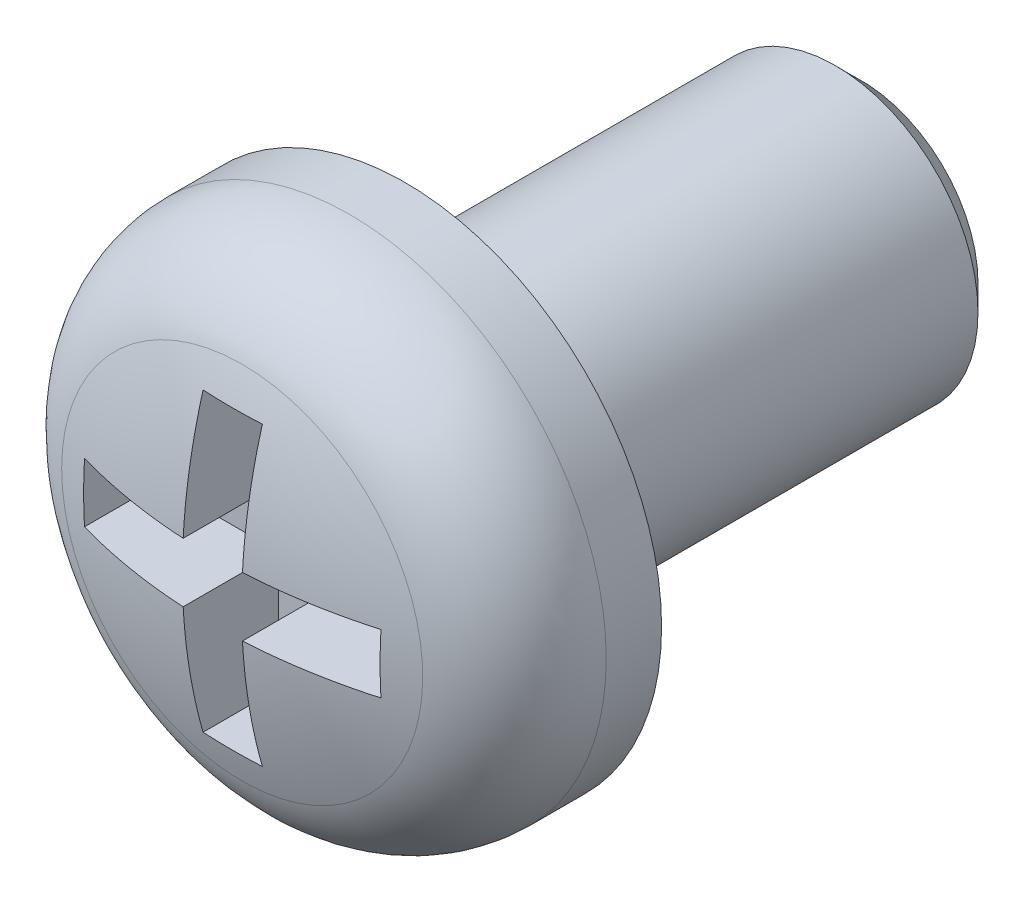
ISO-10303-21;
HEADER;
FILE_DESCRIPTION(('STEP AP214'),'2;1');
FILE_NAME('part.step','',(''),(''),'','','');
FILE_SCHEMA(('AUTOMOTIVE_DESIGN { 1 0 10303 214 1 1 1 1 }'));
ENDSEC;
DATA;
#1=APPLICATION_CONTEXT('core data for automotive mechanical design processes');
#2=APPLICATION_PROTOCOL_DEFINITION('international standard','automotive_design',2000,#1);
#3=PRODUCT_CONTEXT('',#1,'mechanical');
#4=PRODUCT('Part','Part','',(#3));
#5=PRODUCT_RELATED_PRODUCT_CATEGORY('part','',(#4));
#6=PRODUCT_DEFINITION_FORMATION('','',#4);
#7=PRODUCT_DEFINITION_CONTEXT('part definition',#1,'design');
#8=PRODUCT_DEFINITION('design','',#6,#7);
#9=PRODUCT_DEFINITION_SHAPE('','',#8);
#10=(LENGTH_UNIT() NAMED_UNIT(*) SI_UNIT(.MILLI.,.METRE.));
#11=(NAMED_UNIT(*) PLANE_ANGLE_UNIT() SI_UNIT($,.RADIAN.));
#12=(NAMED_UNIT(*) SI_UNIT($,.STERADIAN.) SOLID_ANGLE_UNIT());
#13=UNCERTAINTY_MEASURE_WITH_UNIT(LENGTH_MEASURE(1.E-05),#10,'distance_accuracy_value','');
#14=(GEOMETRIC_REPRESENTATION_CONTEXT(3) GLOBAL_UNCERTAINTY_ASSIGNED_CONTEXT((#13)) GLOBAL_UNIT_ASSIGNED_CONTEXT((#10,
#11,#12)) REPRESENTATION_CONTEXT('',''));
#15=CARTESIAN_POINT('',(0.,0.,0.));
#16=DIRECTION('',(0.,0.,1.));
#17=DIRECTION('',(1.,0.,0.));
#18=AXIS2_PLACEMENT_3D('',#15,#16,#17);
#19=CARTESIAN_POINT('',(0.,0.,-3.05024509803923));
#20=DIRECTION('',(0.,0.,1.));
#21=DIRECTION('',(0.,1.,0.));
#22=AXIS2_PLACEMENT_3D('',#19,#20,#21);
#23=SPHERICAL_SURFACE('',#22,4.75024509803923);
#24=CARTESIAN_POINT('',(0.,0.,1.42836551604378));
#25=DIRECTION('',(0.,0.,-1.));
#26=DIRECTION('',(-1.,0.,0.));
#27=AXIS2_PLACEMENT_3D('',#24,#25,#26);
#28=CIRCLE('',#27,1.58331154826482);
#29=CARTESIAN_POINT('',(-1.58331154826482,0.,1.42836551604378));
#30=VERTEX_POINT('',#29);
#31=EDGE_CURVE('E201',#30,#30,#28,.F.);
#32=ORIENTED_EDGE('',*,*,#31,.T.);
#33=EDGE_LOOP('',(#32));
#34=FACE_BOUND('',#33,.T.);
#35=CARTESIAN_POINT('',(0.259999999999999,0.,-3.05024509803923));
#36=DIRECTION('',(-1.,0.,0.));
#37=DIRECTION('',(0.,-1.,0.));
#38=AXIS2_PLACEMENT_3D('',#35,#36,#37);
#39=CIRCLE('',#38,4.74312433860275);
#40=CARTESIAN_POINT('',(0.259999999999999,0.26,1.6857477747854));
#41=VERTEX_POINT('',#40);
#42=CARTESIAN_POINT('',(0.26,1.3,1.51124900931701));
#43=VERTEX_POINT('',#42);
#44=EDGE_CURVE('E148',#41,#43,#39,.T.);
#45=ORIENTED_EDGE('',*,*,#44,.F.);
#46=CARTESIAN_POINT('',(0.,0.26,-3.05024509803923));
#47=DIRECTION('',(0.,-1.,0.));
#48=DIRECTION('',(1.,0.,0.));
#49=AXIS2_PLACEMENT_3D('',#46,#47,#48);
#50=CIRCLE('',#49,4.74312433860275);
#51=CARTESIAN_POINT('',(1.3,0.26,1.51124900931701));
#52=VERTEX_POINT('',#51);
#53=EDGE_CURVE('E62',#52,#41,#50,.T.);
#54=ORIENTED_EDGE('',*,*,#53,.F.);
#55=CARTESIAN_POINT('',(1.3,0.,-3.05024509803923));
#56=DIRECTION('',(-1.,0.,0.));
#57=DIRECTION('',(0.,-1.,0.));
#58=AXIS2_PLACEMENT_3D('',#55,#56,#57);
#59=CIRCLE('',#58,4.56889795152461);
#60=CARTESIAN_POINT('',(1.3,-0.26,1.51124900931701));
#61=VERTEX_POINT('',#60);
#62=EDGE_CURVE('E194',#61,#52,#59,.T.);
#63=ORIENTED_EDGE('',*,*,#62,.F.);
#64=CARTESIAN_POINT('',(0.,-0.259999999999999,-3.05024509803923));
#65=DIRECTION('',(0.,1.,0.));
#66=DIRECTION('',(-1.,0.,0.));
#67=AXIS2_PLACEMENT_3D('',#64,#65,#66);
#68=CIRCLE('',#67,4.74312433860275);
#69=CARTESIAN_POINT('',(0.26,-0.259999999999999,1.6857477747854));
#70=VERTEX_POINT('',#69);
#71=EDGE_CURVE('E191',#70,#61,#68,.T.);
#72=ORIENTED_EDGE('',*,*,#71,.F.);
#73=CARTESIAN_POINT('',(0.26,0.,-3.05024509803923));
#74=DIRECTION('',(-1.,0.,0.));
#75=DIRECTION('',(0.,-1.,0.));
#76=AXIS2_PLACEMENT_3D('',#73,#74,#75);
#77=CIRCLE('',#76,4.74312433860275);
#78=CARTESIAN_POINT('',(0.259999999999999,-1.3,1.51124900931701));
#79=VERTEX_POINT('',#78);
#80=EDGE_CURVE('E188',#79,#70,#77,.T.);
#81=ORIENTED_EDGE('',*,*,#80,.F.);
#82=CARTESIAN_POINT('',(0.,-1.3,-3.05024509803923));
#83=DIRECTION('',(0.,1.,0.));
#84=DIRECTION('',(-1.,0.,0.));
#85=AXIS2_PLACEMENT_3D('',#82,#83,#84);
#86=CIRCLE('',#85,4.56889795152461);
#87=CARTESIAN_POINT('',(-0.26,-1.3,1.51124900931701));
#88=VERTEX_POINT('',#87);
#89=EDGE_CURVE('E185',#88,#79,#86,.T.);
#90=ORIENTED_EDGE('',*,*,#89,.F.);
#91=CARTESIAN_POINT('',(-0.26,0.,-3.05024509803923));
#92=DIRECTION('',(1.,0.,0.));
#93=DIRECTION('',(0.,1.,0.));
#94=AXIS2_PLACEMENT_3D('',#91,#92,#93);
#95=CIRCLE('',#94,4.74312433860275);
#96=CARTESIAN_POINT('',(-0.26,-0.26,1.6857477747854));
#97=VERTEX_POINT('',#96);
#98=EDGE_CURVE('E182',#97,#88,#95,.T.);
#99=ORIENTED_EDGE('',*,*,#98,.F.);
#100=CARTESIAN_POINT('',(0.,-0.26,-3.05024509803923));
#101=DIRECTION('',(0.,1.,0.));
#102=DIRECTION('',(-1.,0.,0.));
#103=AXIS2_PLACEMENT_3D('',#100,#101,#102);
#104=CIRCLE('',#103,4.74312433860275);
#105=CARTESIAN_POINT('',(-1.3,-0.259999999999999,1.51124900931701));
#106=VERTEX_POINT('',#105);
#107=EDGE_CURVE('E180',#106,#97,#104,.T.);
#108=ORIENTED_EDGE('',*,*,#107,.F.);
#109=CARTESIAN_POINT('',(-1.3,0.,-3.05024509803923));
#110=DIRECTION('',(1.,0.,0.));
#111=DIRECTION('',(0.,1.,0.));
#112=AXIS2_PLACEMENT_3D('',#109,#110,#111);
#113=CIRCLE('',#112,4.56889795152461);
#114=CARTESIAN_POINT('',(-1.3,0.26,1.51124900931701));
#115=VERTEX_POINT('',#114);
#116=EDGE_CURVE('E177',#115,#106,#113,.T.);
#117=ORIENTED_EDGE('',*,*,#116,.F.);
#118=CARTESIAN_POINT('',(0.,0.26,-3.05024509803923));
#119=DIRECTION('',(0.,-1.,0.));
#120=DIRECTION('',(1.,0.,0.));
#121=AXIS2_PLACEMENT_3D('',#118,#119,#120);
#122=CIRCLE('',#121,4.74312433860275);
#123=CARTESIAN_POINT('',(-0.26,0.26,1.6857477747854));
#124=VERTEX_POINT('',#123);
#125=EDGE_CURVE('E174',#124,#115,#122,.T.);
#126=ORIENTED_EDGE('',*,*,#125,.F.);
#127=CARTESIAN_POINT('',(-0.26,0.,-3.05024509803923));
#128=DIRECTION('',(1.,0.,0.));
#129=DIRECTION('',(0.,1.,0.));
#130=AXIS2_PLACEMENT_3D('',#127,#128,#129);
#131=CIRCLE('',#130,4.74312433860275);
#132=CARTESIAN_POINT('',(-0.259999999999999,1.3,1.51124900931701));
#133=VERTEX_POINT('',#132);
#134=EDGE_CURVE('E171',#133,#124,#131,.T.);
#135=ORIENTED_EDGE('',*,*,#134,.F.);
#136=CARTESIAN_POINT('',(0.,1.3,-3.05024509803923));
#137=DIRECTION('',(0.,-1.,0.));
#138=DIRECTION('',(0.,0.,-1.));
#139=AXIS2_PLACEMENT_3D('',#136,#137,#138);
#140=CIRCLE('',#139,4.56889795152461);
#141=EDGE_CURVE('E168',#43,#133,#140,.T.);
#142=ORIENTED_EDGE('',*,*,#141,.F.);
#143=EDGE_LOOP('',(#45,#54,#63,#72,#81,#90,#99,#108,#117,#126,#135,#142));
#144=FACE_BOUND('',#143,.T.);
#145=ADVANCED_FACE('F38',(#34,#144),#23,.T.);
#146=CARTESIAN_POINT('',(0.,0.,33.7359697729939));
#147=DIRECTION('',(0.,0.,1.));
#148=DIRECTION('',(1.,0.,0.));
#149=AXIS2_PLACEMENT_3D('',#146,#147,#148);
#150=CYLINDRICAL_SURFACE('',#149,2.25);
#151=CARTESIAN_POINT('',(0.,0.,0.485548772560025));
#152=DIRECTION('',(0.,0.,-1.));
#153=DIRECTION('',(-1.,0.,0.));
#154=AXIS2_PLACEMENT_3D('',#151,#152,#153);
#155=CIRCLE('',#154,2.25);
#156=CARTESIAN_POINT('',(-2.25,0.,0.485548772560025));
#157=VERTEX_POINT('',#156);
#158=EDGE_CURVE('E205',#157,#157,#155,.T.);
#159=ORIENTED_EDGE('',*,*,#158,.T.);
#160=EDGE_LOOP('',(#159));
#161=FACE_BOUND('',#160,.T.);
#162=CARTESIAN_POINT('',(0.,0.,0.));
#163=DIRECTION('',(0.,0.,1.));
#164=DIRECTION('',(1.,0.,0.));
#165=AXIS2_PLACEMENT_3D('',#162,#163,#164);
#166=CIRCLE('',#165,2.25);
#167=CARTESIAN_POINT('',(2.25,0.,0.));
#168=VERTEX_POINT('',#167);
#169=EDGE_CURVE('E158',#168,#168,#166,.T.);
#170=ORIENTED_EDGE('',*,*,#169,.T.);
#171=EDGE_LOOP('',(#170));
#172=FACE_BOUND('',#171,.T.);
#173=ADVANCED_FACE('F225',(#161,#172),#150,.T.);
#174=CARTESIAN_POINT('',(0.,2.25,0.));
#175=DIRECTION('',(0.,0.,1.));
#176=DIRECTION('',(1.,0.,0.));
#177=AXIS2_PLACEMENT_3D('',#174,#175,#176);
#178=PLANE('',#177);
#179=ORIENTED_EDGE('',*,*,#169,.F.);
#180=EDGE_LOOP('',(#179));
#181=FACE_BOUND('',#180,.T.);
#182=CARTESIAN_POINT('',(0.,0.,0.));
#183=DIRECTION('',(0.,0.,1.));
#184=DIRECTION('',(1.,0.,0.));
#185=AXIS2_PLACEMENT_3D('',#182,#183,#184);
#186=CIRCLE('',#185,1.25);
#187=CARTESIAN_POINT('',(1.25,0.,0.));
#188=VERTEX_POINT('',#187);
#189=EDGE_CURVE('E151',#188,#188,#186,.T.);
#190=ORIENTED_EDGE('',*,*,#189,.T.);
#191=EDGE_LOOP('',(#190));
#192=FACE_BOUND('',#191,.T.);
#193=ADVANCED_FACE('F231',(#181,#192),#178,.F.);
#194=CARTESIAN_POINT('',(0.,0.,33.7359697729939));
#195=DIRECTION('',(0.,0.,1.));
#196=DIRECTION('',(1.,0.,0.));
#197=AXIS2_PLACEMENT_3D('',#194,#195,#196);
#198=CYLINDRICAL_SURFACE('',#197,1.25);
#199=CARTESIAN_POINT('',(0.,0.,-3.775));
#200=DIRECTION('',(0.,0.,1.));
#201=DIRECTION('',(1.,0.,0.));
#202=AXIS2_PLACEMENT_3D('',#199,#200,#201);
#203=CIRCLE('',#202,1.25);
#204=CARTESIAN_POINT('',(1.25,0.,-3.775));
#205=VERTEX_POINT('',#204);
#206=EDGE_CURVE('E47',#205,#205,#203,.T.);
#207=ORIENTED_EDGE('',*,*,#206,.T.);
#208=EDGE_LOOP('',(#207));
#209=FACE_BOUND('',#208,.T.);
#210=ORIENTED_EDGE('',*,*,#189,.F.);
#211=EDGE_LOOP('',(#210));
#212=FACE_BOUND('',#211,.T.);
#213=ADVANCED_FACE('F213',(#209,#212),#198,.T.);
#214=CARTESIAN_POINT('',(0.,1.25,-4.));
#215=DIRECTION('',(0.,0.,1.));
#216=DIRECTION('',(1.,0.,0.));
#217=AXIS2_PLACEMENT_3D('',#214,#215,#216);
#218=PLANE('',#217);
#219=CARTESIAN_POINT('',(0.,0.,-4.));
#220=DIRECTION('',(0.,0.,1.));
#221=DIRECTION('',(1.,0.,0.));
#222=AXIS2_PLACEMENT_3D('',#219,#220,#221);
#223=CIRCLE('',#222,1.025);
#224=CARTESIAN_POINT('',(1.025,0.,-4.));
#225=VERTEX_POINT('',#224);
#226=EDGE_CURVE('E11',#225,#225,#223,.F.);
#227=ORIENTED_EDGE('',*,*,#226,.T.);
#228=EDGE_LOOP('',(#227));
#229=FACE_BOUND('',#228,.T.);
#230=ADVANCED_FACE('F241',(#229),#218,.F.);
#231=CARTESIAN_POINT('',(0.259999999999999,0.26,0.85));
#232=DIRECTION('',(-1.,0.,0.));
#233=DIRECTION('',(0.,-1.,0.));
#234=AXIS2_PLACEMENT_3D('',#231,#232,#233);
#235=PLANE('',#234);
#236=ORIENTED_EDGE('',*,*,#44,.T.);
#237=DIRECTION('',(0.,0.,1.));
#238=VECTOR('',#237,1.);
#239=CARTESIAN_POINT('',(0.26,1.3,0.85));
#240=LINE('',#239,#238);
#241=CARTESIAN_POINT('',(0.26,1.3,0.85));
#242=VERTEX_POINT('',#241);
#243=EDGE_CURVE('E54',#242,#43,#240,.T.);
#244=ORIENTED_EDGE('',*,*,#243,.F.);
#245=DIRECTION('',(0.,-1.,0.));
#246=VECTOR('',#245,1.);
#247=CARTESIAN_POINT('',(0.259999999999999,0.26,0.85));
#248=LINE('',#247,#246);
#249=CARTESIAN_POINT('',(0.259999999999999,0.26,0.85));
#250=VERTEX_POINT('',#249);
#251=EDGE_CURVE('E130',#242,#250,#248,.T.);
#252=ORIENTED_EDGE('',*,*,#251,.T.);
#253=DIRECTION('',(0.,0.,1.));
#254=VECTOR('',#253,1.);
#255=CARTESIAN_POINT('',(0.259999999999999,0.26,0.85));
#256=LINE('',#255,#254);
#257=EDGE_CURVE('E152',#250,#41,#256,.T.);
#258=ORIENTED_EDGE('',*,*,#257,.T.);
#259=EDGE_LOOP('',(#236,#244,#252,#258));
#260=FACE_BOUND('',#259,.T.);
#261=ADVANCED_FACE('F146',(#260),#235,.T.);
#262=CARTESIAN_POINT('',(1.3,0.26,0.85));
#263=DIRECTION('',(0.,-1.,0.));
#264=DIRECTION('',(1.,0.,0.));
#265=AXIS2_PLACEMENT_3D('',#262,#263,#264);
#266=PLANE('',#265);
#267=ORIENTED_EDGE('',*,*,#53,.T.);
#268=ORIENTED_EDGE('',*,*,#257,.F.);
#269=DIRECTION('',(1.,0.,0.));
#270=VECTOR('',#269,1.);
#271=CARTESIAN_POINT('',(1.3,0.26,0.85));
#272=LINE('',#271,#270);
#273=CARTESIAN_POINT('',(1.3,0.26,0.85));
#274=VERTEX_POINT('',#273);
#275=EDGE_CURVE('E136',#250,#274,#272,.T.);
#276=ORIENTED_EDGE('',*,*,#275,.T.);
#277=DIRECTION('',(0.,0.,1.));
#278=VECTOR('',#277,1.);
#279=CARTESIAN_POINT('',(1.3,0.26,0.85));
#280=LINE('',#279,#278);
#281=EDGE_CURVE('E161',#274,#52,#280,.T.);
#282=ORIENTED_EDGE('',*,*,#281,.T.);
#283=EDGE_LOOP('',(#267,#268,#276,#282));
#284=FACE_BOUND('',#283,.T.);
#285=ADVANCED_FACE('F247',(#284),#266,.T.);
#286=CARTESIAN_POINT('',(1.3,-0.26,0.85));
#287=DIRECTION('',(-1.,0.,0.));
#288=DIRECTION('',(0.,-1.,0.));
#289=AXIS2_PLACEMENT_3D('',#286,#287,#288);
#290=PLANE('',#289);
#291=ORIENTED_EDGE('',*,*,#62,.T.);
#292=ORIENTED_EDGE('',*,*,#281,.F.);
#293=DIRECTION('',(0.,-1.,0.));
#294=VECTOR('',#293,1.);
#295=CARTESIAN_POINT('',(1.3,0.,0.85));
#296=LINE('',#295,#294);
#297=CARTESIAN_POINT('',(1.3,-0.26,0.85));
#298=VERTEX_POINT('',#297);
#299=EDGE_CURVE('E488',#274,#298,#296,.T.);
#300=ORIENTED_EDGE('',*,*,#299,.T.);
#301=DIRECTION('',(0.,0.,1.));
#302=VECTOR('',#301,1.);
#303=CARTESIAN_POINT('',(1.3,-0.26,0.85));
#304=LINE('',#303,#302);
#305=EDGE_CURVE('E481',#298,#61,#304,.T.);
#306=ORIENTED_EDGE('',*,*,#305,.T.);
#307=EDGE_LOOP('',(#291,#292,#300,#306));
#308=FACE_BOUND('',#307,.T.);
#309=ADVANCED_FACE('F250',(#308),#290,.T.);
#310=CARTESIAN_POINT('',(0.26,-0.259999999999999,0.85));
#311=DIRECTION('',(0.,1.,0.));
#312=DIRECTION('',(-1.,0.,0.));
#313=AXIS2_PLACEMENT_3D('',#310,#311,#312);
#314=PLANE('',#313);
#315=ORIENTED_EDGE('',*,*,#71,.T.);
#316=ORIENTED_EDGE('',*,*,#305,.F.);
#317=DIRECTION('',(-1.,0.,0.));
#318=VECTOR('',#317,1.);
#319=CARTESIAN_POINT('',(0.26,-0.259999999999999,0.85));
#320=LINE('',#319,#318);
#321=CARTESIAN_POINT('',(0.26,-0.259999999999999,0.85));
#322=VERTEX_POINT('',#321);
#323=EDGE_CURVE('E490',#298,#322,#320,.T.);
#324=ORIENTED_EDGE('',*,*,#323,.T.);
#325=DIRECTION('',(0.,0.,1.));
#326=VECTOR('',#325,1.);
#327=CARTESIAN_POINT('',(0.26,-0.259999999999999,0.85));
#328=LINE('',#327,#326);
#329=EDGE_CURVE('E477',#322,#70,#328,.T.);
#330=ORIENTED_EDGE('',*,*,#329,.T.);
#331=EDGE_LOOP('',(#315,#316,#324,#330));
#332=FACE_BOUND('',#331,.T.);
#333=ADVANCED_FACE('F253',(#332),#314,.T.);
#334=CARTESIAN_POINT('',(0.259999999999999,-1.3,0.85));
#335=DIRECTION('',(-1.,0.,0.));
#336=DIRECTION('',(0.,-1.,0.));
#337=AXIS2_PLACEMENT_3D('',#334,#335,#336);
#338=PLANE('',#337);
#339=ORIENTED_EDGE('',*,*,#80,.T.);
#340=ORIENTED_EDGE('',*,*,#329,.F.);
#341=DIRECTION('',(0.,-1.,0.));
#342=VECTOR('',#341,1.);
#343=CARTESIAN_POINT('',(0.259999999999999,-1.3,0.85));
#344=LINE('',#343,#342);
#345=CARTESIAN_POINT('',(0.259999999999999,-1.3,0.85));
#346=VERTEX_POINT('',#345);
#347=EDGE_CURVE('E494',#322,#346,#344,.T.);
#348=ORIENTED_EDGE('',*,*,#347,.T.);
#349=DIRECTION('',(0.,0.,1.));
#350=VECTOR('',#349,1.);
#351=CARTESIAN_POINT('',(0.259999999999999,-1.3,0.85));
#352=LINE('',#351,#350);
#353=EDGE_CURVE('E473',#346,#79,#352,.T.);
#354=ORIENTED_EDGE('',*,*,#353,.T.);
#355=EDGE_LOOP('',(#339,#340,#348,#354));
#356=FACE_BOUND('',#355,.T.);
#357=ADVANCED_FACE('F257',(#356),#338,.T.);
#358=CARTESIAN_POINT('',(-0.26,-1.3,0.85));
#359=DIRECTION('',(0.,1.,0.));
#360=DIRECTION('',(-1.,0.,0.));
#361=AXIS2_PLACEMENT_3D('',#358,#359,#360);
#362=PLANE('',#361);
#363=ORIENTED_EDGE('',*,*,#89,.T.);
#364=ORIENTED_EDGE('',*,*,#353,.F.);
#365=DIRECTION('',(-1.,0.,0.));
#366=VECTOR('',#365,1.);
#367=CARTESIAN_POINT('',(0.,-1.3,0.85));
#368=LINE('',#367,#366);
#369=CARTESIAN_POINT('',(-0.26,-1.3,0.85));
#370=VERTEX_POINT('',#369);
#371=EDGE_CURVE('E499',#346,#370,#368,.T.);
#372=ORIENTED_EDGE('',*,*,#371,.T.);
#373=DIRECTION('',(0.,0.,1.));
#374=VECTOR('',#373,1.);
#375=CARTESIAN_POINT('',(-0.26,-1.3,0.85));
#376=LINE('',#375,#374);
#377=EDGE_CURVE('E465',#370,#88,#376,.T.);
#378=ORIENTED_EDGE('',*,*,#377,.T.);
#379=EDGE_LOOP('',(#363,#364,#372,#378));
#380=FACE_BOUND('',#379,.T.);
#381=ADVANCED_FACE('F261',(#380),#362,.T.);
#382=CARTESIAN_POINT('',(-0.26,-0.26,0.85));
#383=DIRECTION('',(1.,0.,0.));
#384=DIRECTION('',(0.,1.,0.));
#385=AXIS2_PLACEMENT_3D('',#382,#383,#384);
#386=PLANE('',#385);
#387=ORIENTED_EDGE('',*,*,#98,.T.);
#388=ORIENTED_EDGE('',*,*,#377,.F.);
#389=DIRECTION('',(0.,1.,0.));
#390=VECTOR('',#389,1.);
#391=CARTESIAN_POINT('',(-0.26,-0.26,0.85));
#392=LINE('',#391,#390);
#393=CARTESIAN_POINT('',(-0.26,-0.26,0.85));
#394=VERTEX_POINT('',#393);
#395=EDGE_CURVE('E507',#370,#394,#392,.T.);
#396=ORIENTED_EDGE('',*,*,#395,.T.);
#397=DIRECTION('',(0.,0.,1.));
#398=VECTOR('',#397,1.);
#399=CARTESIAN_POINT('',(-0.26,-0.26,0.85));
#400=LINE('',#399,#398);
#401=EDGE_CURVE('E461',#394,#97,#400,.T.);
#402=ORIENTED_EDGE('',*,*,#401,.T.);
#403=EDGE_LOOP('',(#387,#388,#396,#402));
#404=FACE_BOUND('',#403,.T.);
#405=ADVANCED_FACE('F265',(#404),#386,.T.);
#406=CARTESIAN_POINT('',(-1.3,-0.259999999999999,0.85));
#407=DIRECTION('',(0.,1.,0.));
#408=DIRECTION('',(-1.,0.,0.));
#409=AXIS2_PLACEMENT_3D('',#406,#407,#408);
#410=PLANE('',#409);
#411=ORIENTED_EDGE('',*,*,#107,.T.);
#412=ORIENTED_EDGE('',*,*,#401,.F.);
#413=DIRECTION('',(-1.,0.,0.));
#414=VECTOR('',#413,1.);
#415=CARTESIAN_POINT('',(-1.3,-0.259999999999999,0.85));
#416=LINE('',#415,#414);
#417=CARTESIAN_POINT('',(-1.3,-0.259999999999999,0.85));
#418=VERTEX_POINT('',#417);
#419=EDGE_CURVE('E459',#394,#418,#416,.T.);
#420=ORIENTED_EDGE('',*,*,#419,.T.);
#421=DIRECTION('',(0.,0.,1.));
#422=VECTOR('',#421,1.);
#423=CARTESIAN_POINT('',(-1.3,-0.259999999999999,0.85));
#424=LINE('',#423,#422);
#425=EDGE_CURVE('E454',#418,#106,#424,.T.);
#426=ORIENTED_EDGE('',*,*,#425,.T.);
#427=EDGE_LOOP('',(#411,#412,#420,#426));
#428=FACE_BOUND('',#427,.T.);
#429=ADVANCED_FACE('F269',(#428),#410,.T.);
#430=CARTESIAN_POINT('',(-1.3,0.26,0.85));
#431=DIRECTION('',(1.,0.,0.));
#432=DIRECTION('',(0.,1.,0.));
#433=AXIS2_PLACEMENT_3D('',#430,#431,#432);
#434=PLANE('',#433);
#435=ORIENTED_EDGE('',*,*,#116,.T.);
#436=ORIENTED_EDGE('',*,*,#425,.F.);
#437=DIRECTION('',(0.,1.,0.));
#438=VECTOR('',#437,1.);
#439=CARTESIAN_POINT('',(-1.3,0.,0.85));
#440=LINE('',#439,#438);
#441=CARTESIAN_POINT('',(-1.3,0.26,0.85));
#442=VERTEX_POINT('',#441);
#443=EDGE_CURVE('E511',#418,#442,#440,.T.);
#444=ORIENTED_EDGE('',*,*,#443,.T.);
#445=DIRECTION('',(0.,0.,1.));
#446=VECTOR('',#445,1.);
#447=CARTESIAN_POINT('',(-1.3,0.26,0.85));
#448=LINE('',#447,#446);
#449=EDGE_CURVE('E447',#442,#115,#448,.T.);
#450=ORIENTED_EDGE('',*,*,#449,.T.);
#451=EDGE_LOOP('',(#435,#436,#444,#450));
#452=FACE_BOUND('',#451,.T.);
#453=ADVANCED_FACE('F273',(#452),#434,.T.);
#454=CARTESIAN_POINT('',(-0.26,0.26,0.85));
#455=DIRECTION('',(0.,-1.,0.));
#456=DIRECTION('',(1.,0.,0.));
#457=AXIS2_PLACEMENT_3D('',#454,#455,#456);
#458=PLANE('',#457);
#459=ORIENTED_EDGE('',*,*,#125,.T.);
#460=ORIENTED_EDGE('',*,*,#449,.F.);
#461=DIRECTION('',(1.,0.,0.));
#462=VECTOR('',#461,1.);
#463=CARTESIAN_POINT('',(-0.26,0.26,0.85));
#464=LINE('',#463,#462);
#465=CARTESIAN_POINT('',(-0.26,0.26,0.85));
#466=VERTEX_POINT('',#465);
#467=EDGE_CURVE('E445',#442,#466,#464,.T.);
#468=ORIENTED_EDGE('',*,*,#467,.T.);
#469=DIRECTION('',(0.,0.,1.));
#470=VECTOR('',#469,1.);
#471=CARTESIAN_POINT('',(-0.26,0.26,0.85));
#472=LINE('',#471,#470);
#473=EDGE_CURVE('E440',#466,#124,#472,.T.);
#474=ORIENTED_EDGE('',*,*,#473,.T.);
#475=EDGE_LOOP('',(#459,#460,#468,#474));
#476=FACE_BOUND('',#475,.T.);
#477=ADVANCED_FACE('F277',(#476),#458,.T.);
#478=CARTESIAN_POINT('',(-0.259999999999999,1.3,0.85));
#479=DIRECTION('',(1.,0.,0.));
#480=DIRECTION('',(0.,1.,0.));
#481=AXIS2_PLACEMENT_3D('',#478,#479,#480);
#482=PLANE('',#481);
#483=ORIENTED_EDGE('',*,*,#134,.T.);
#484=ORIENTED_EDGE('',*,*,#473,.F.);
#485=DIRECTION('',(0.,1.,0.));
#486=VECTOR('',#485,1.);
#487=CARTESIAN_POINT('',(-0.259999999999999,1.3,0.85));
#488=LINE('',#487,#486);
#489=CARTESIAN_POINT('',(-0.259999999999999,1.3,0.85));
#490=VERTEX_POINT('',#489);
#491=EDGE_CURVE('E516',#466,#490,#488,.T.);
#492=ORIENTED_EDGE('',*,*,#491,.T.);
#493=DIRECTION('',(0.,0.,1.));
#494=VECTOR('',#493,1.);
#495=CARTESIAN_POINT('',(-0.259999999999999,1.3,0.85));
#496=LINE('',#495,#494);
#497=EDGE_CURVE('E143',#490,#133,#496,.T.);
#498=ORIENTED_EDGE('',*,*,#497,.T.);
#499=EDGE_LOOP('',(#483,#484,#492,#498));
#500=FACE_BOUND('',#499,.T.);
#501=ADVANCED_FACE('F281',(#500),#482,.T.);
#502=CARTESIAN_POINT('',(0.,1.3,0.85));
#503=DIRECTION('',(0.,-1.,0.));
#504=DIRECTION('',(0.,0.,-1.));
#505=AXIS2_PLACEMENT_3D('',#502,#503,#504);
#506=PLANE('',#505);
#507=ORIENTED_EDGE('',*,*,#141,.T.);
#508=ORIENTED_EDGE('',*,*,#497,.F.);
#509=DIRECTION('',(1.,0.,0.));
#510=VECTOR('',#509,1.);
#511=CARTESIAN_POINT('',(0.26,1.3,0.85));
#512=LINE('',#511,#510);
#513=EDGE_CURVE('E133',#490,#242,#512,.T.);
#514=ORIENTED_EDGE('',*,*,#513,.T.);
#515=ORIENTED_EDGE('',*,*,#243,.T.);
#516=EDGE_LOOP('',(#507,#508,#514,#515));
#517=FACE_BOUND('',#516,.T.);
#518=ADVANCED_FACE('F141',(#517),#506,.T.);
#519=CARTESIAN_POINT('',(-0.259999999999999,1.3,0.85));
#520=DIRECTION('',(0.,0.,1.));
#521=DIRECTION('',(1.,0.,0.));
#522=AXIS2_PLACEMENT_3D('',#519,#520,#521);
#523=PLANE('',#522);
#524=ORIENTED_EDGE('',*,*,#513,.F.);
#525=ORIENTED_EDGE('',*,*,#491,.F.);
#526=ORIENTED_EDGE('',*,*,#467,.F.);
#527=ORIENTED_EDGE('',*,*,#443,.F.);
#528=ORIENTED_EDGE('',*,*,#419,.F.);
#529=ORIENTED_EDGE('',*,*,#395,.F.);
#530=ORIENTED_EDGE('',*,*,#371,.F.);
#531=ORIENTED_EDGE('',*,*,#347,.F.);
#532=ORIENTED_EDGE('',*,*,#323,.F.);
#533=ORIENTED_EDGE('',*,*,#299,.F.);
#534=ORIENTED_EDGE('',*,*,#275,.F.);
#535=ORIENTED_EDGE('',*,*,#251,.F.);
#536=EDGE_LOOP('',(#524,#525,#526,#527,#528,#529,#530,#531,#532,#533,#534,#535));
#537=FACE_BOUND('',#536,.T.);
#538=ADVANCED_FACE('F131',(#537),#523,.T.);
#539=CARTESIAN_POINT('',(0.,0.,0.485548772560026));
#540=DIRECTION('',(0.,0.,-1.));
#541=DIRECTION('',(-1.,0.,0.));
#542=AXIS2_PLACEMENT_3D('',#539,#540,#541);
#543=TOROIDAL_SURFACE('',#542,1.25,1.);
#544=ORIENTED_EDGE('',*,*,#158,.F.);
#545=EDGE_LOOP('',(#544));
#546=FACE_BOUND('',#545,.T.);
#547=ORIENTED_EDGE('',*,*,#31,.F.);
#548=EDGE_LOOP('',(#547));
#549=FACE_BOUND('',#548,.T.);
#550=ADVANCED_FACE('F217',(#546,#549),#543,.T.);
#551=CARTESIAN_POINT('',(0.,0.,-3.775));
#552=DIRECTION('',(0.,0.,1.));
#553=DIRECTION('',(1.,0.,0.));
#554=AXIS2_PLACEMENT_3D('',#551,#552,#553);
#555=CONICAL_SURFACE('',#554,1.25,0.785398163397441);
#556=ORIENTED_EDGE('',*,*,#226,.F.);
#557=EDGE_LOOP('',(#556));
#558=FACE_BOUND('',#557,.T.);
#559=ORIENTED_EDGE('',*,*,#206,.F.);
#560=EDGE_LOOP('',(#559));
#561=FACE_BOUND('',#560,.T.);
#562=ADVANCED_FACE('F40',(#558,#561),#555,.T.);
#563=CLOSED_SHELL('',(#145,#173,#193,#213,#230,#261,#285,#309,#333,#357,#381,#405,#429,#453,
#477,#501,#518,#538,#550,#562));
#564=MANIFOLD_SOLID_BREP('B2',#563);
#565=ADVANCED_BREP_SHAPE_REPRESENTATION('',(#18,#564),#14);
#566=SHAPE_DEFINITION_REPRESENTATION(#9,#565);
ENDSEC;
END-ISO-10303-21;
